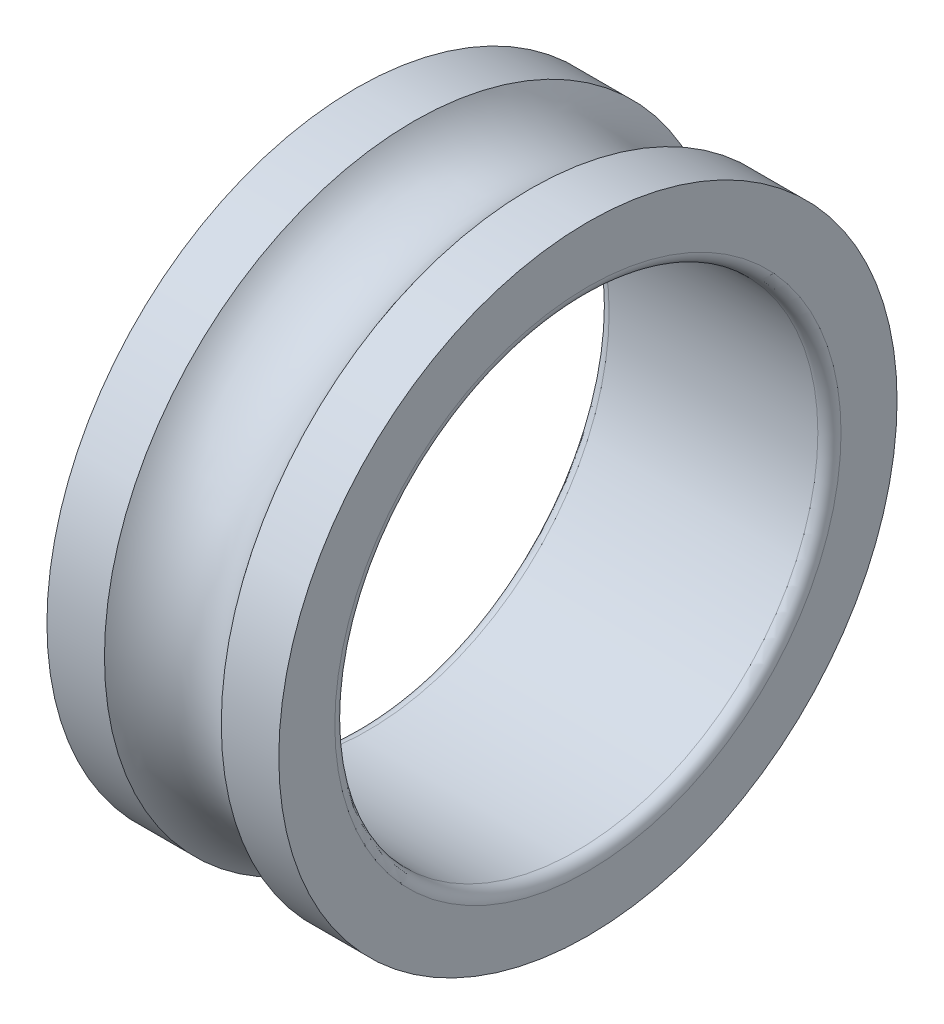
ISO-10303-21;
HEADER;
FILE_DESCRIPTION(('STEP AP214'),'2;1');
FILE_NAME('part.step','',(''),(''),'','','');
FILE_SCHEMA(('AUTOMOTIVE_DESIGN { 1 0 10303 214 1 1 1 1 }'));
ENDSEC;
DATA;
#1=APPLICATION_CONTEXT('core data for automotive mechanical design processes');
#2=APPLICATION_PROTOCOL_DEFINITION('international standard','automotive_design',2000,#1);
#3=PRODUCT_CONTEXT('',#1,'mechanical');
#4=PRODUCT('Part','Part','',(#3));
#5=PRODUCT_RELATED_PRODUCT_CATEGORY('part','',(#4));
#6=PRODUCT_DEFINITION_FORMATION('','',#4);
#7=PRODUCT_DEFINITION_CONTEXT('part definition',#1,'design');
#8=PRODUCT_DEFINITION('design','',#6,#7);
#9=PRODUCT_DEFINITION_SHAPE('','',#8);
#10=(LENGTH_UNIT() NAMED_UNIT(*) SI_UNIT(.MILLI.,.METRE.));
#11=(NAMED_UNIT(*) PLANE_ANGLE_UNIT() SI_UNIT($,.RADIAN.));
#12=(NAMED_UNIT(*) SI_UNIT($,.STERADIAN.) SOLID_ANGLE_UNIT());
#13=UNCERTAINTY_MEASURE_WITH_UNIT(LENGTH_MEASURE(1.E-05),#10,'distance_accuracy_value','');
#14=(GEOMETRIC_REPRESENTATION_CONTEXT(3) GLOBAL_UNCERTAINTY_ASSIGNED_CONTEXT((#13)) GLOBAL_UNIT_ASSIGNED_CONTEXT((#10,
#11,#12)) REPRESENTATION_CONTEXT('',''));
#15=CARTESIAN_POINT('',(0.,0.,0.));
#16=DIRECTION('',(0.,0.,1.));
#17=DIRECTION('',(1.,0.,0.));
#18=AXIS2_PLACEMENT_3D('',#15,#16,#17);
#19=CARTESIAN_POINT('',(0.,0.,0.));
#20=DIRECTION('',(-1.,0.,0.));
#21=DIRECTION('',(0.,0.,1.));
#22=AXIS2_PLACEMENT_3D('',#19,#20,#21);
#23=CYLINDRICAL_SURFACE('',#22,16.);
#24=CARTESIAN_POINT('',(0.,0.,0.));
#25=DIRECTION('',(-1.,0.,0.));
#26=DIRECTION('',(0.,0.,1.));
#27=AXIS2_PLACEMENT_3D('',#24,#25,#26);
#28=CIRCLE('',#27,16.);
#29=CARTESIAN_POINT('',(0.,0.,16.));
#30=VERTEX_POINT('',#29);
#31=EDGE_CURVE('E10',#30,#30,#28,.T.);
#32=ORIENTED_EDGE('',*,*,#31,.F.);
#33=EDGE_LOOP('',(#32));
#34=FACE_BOUND('',#33,.T.);
#35=CARTESIAN_POINT('',(2.97695196127411,0.,0.));
#36=DIRECTION('',(-1.,0.,0.));
#37=DIRECTION('',(0.,0.,1.));
#38=AXIS2_PLACEMENT_3D('',#35,#36,#37);
#39=CIRCLE('',#38,16.);
#40=CARTESIAN_POINT('',(2.97695196127411,0.,16.));
#41=VERTEX_POINT('',#40);
#42=EDGE_CURVE('E42',#41,#41,#39,.T.);
#43=ORIENTED_EDGE('',*,*,#42,.T.);
#44=EDGE_LOOP('',(#43));
#45=FACE_BOUND('',#44,.T.);
#46=ADVANCED_FACE('F14',(#34,#45),#23,.T.);
#47=CARTESIAN_POINT('',(0.,16.0000000000001,0.));
#48=DIRECTION('',(1.,0.,0.));
#49=DIRECTION('',(0.,0.,-1.));
#50=AXIS2_PLACEMENT_3D('',#47,#48,#49);
#51=PLANE('',#50);
#52=CARTESIAN_POINT('',(0.,0.,0.));
#53=DIRECTION('',(-1.,0.,0.));
#54=DIRECTION('',(0.,0.,1.));
#55=AXIS2_PLACEMENT_3D('',#52,#53,#54);
#56=CIRCLE('',#55,13.1);
#57=CARTESIAN_POINT('',(0.,0.,13.1));
#58=VERTEX_POINT('',#57);
#59=EDGE_CURVE('E20',#58,#58,#56,.T.);
#60=ORIENTED_EDGE('',*,*,#59,.F.);
#61=EDGE_LOOP('',(#60));
#62=FACE_BOUND('',#61,.T.);
#63=ORIENTED_EDGE('',*,*,#31,.T.);
#64=EDGE_LOOP('',(#63));
#65=FACE_BOUND('',#64,.T.);
#66=ADVANCED_FACE('F60',(#62,#65),#51,.F.);
#67=CARTESIAN_POINT('',(0.6,0.,0.));
#68=DIRECTION('',(-1.,0.,0.));
#69=DIRECTION('',(0.,0.,1.));
#70=AXIS2_PLACEMENT_3D('',#67,#68,#69);
#71=TOROIDAL_SURFACE('',#70,13.1,0.6);
#72=CARTESIAN_POINT('',(0.6,0.,0.));
#73=DIRECTION('',(-1.,0.,0.));
#74=DIRECTION('',(0.,0.,1.));
#75=AXIS2_PLACEMENT_3D('',#72,#73,#74);
#76=CIRCLE('',#75,12.5);
#77=CARTESIAN_POINT('',(0.6,0.,12.5));
#78=VERTEX_POINT('',#77);
#79=EDGE_CURVE('E24',#78,#78,#76,.T.);
#80=ORIENTED_EDGE('',*,*,#79,.F.);
#81=EDGE_LOOP('',(#80));
#82=FACE_BOUND('',#81,.T.);
#83=ORIENTED_EDGE('',*,*,#59,.T.);
#84=EDGE_LOOP('',(#83));
#85=FACE_BOUND('',#84,.T.);
#86=ADVANCED_FACE('F65',(#82,#85),#71,.T.);
#87=CARTESIAN_POINT('',(0.,0.,0.));
#88=DIRECTION('',(-1.,0.,0.));
#89=DIRECTION('',(0.,0.,1.));
#90=AXIS2_PLACEMENT_3D('',#87,#88,#89);
#91=CYLINDRICAL_SURFACE('',#90,12.5);
#92=CARTESIAN_POINT('',(11.4,0.,0.));
#93=DIRECTION('',(-1.,0.,0.));
#94=DIRECTION('',(0.,0.,1.));
#95=AXIS2_PLACEMENT_3D('',#92,#93,#94);
#96=CIRCLE('',#95,12.5);
#97=CARTESIAN_POINT('',(11.4,0.,12.5));
#98=VERTEX_POINT('',#97);
#99=EDGE_CURVE('E28',#98,#98,#96,.T.);
#100=ORIENTED_EDGE('',*,*,#99,.F.);
#101=EDGE_LOOP('',(#100));
#102=FACE_BOUND('',#101,.T.);
#103=ORIENTED_EDGE('',*,*,#79,.T.);
#104=EDGE_LOOP('',(#103));
#105=FACE_BOUND('',#104,.T.);
#106=ADVANCED_FACE('F70',(#102,#105),#91,.F.);
#107=CARTESIAN_POINT('',(11.4,0.,0.));
#108=DIRECTION('',(-1.,0.,0.));
#109=DIRECTION('',(0.,0.,1.));
#110=AXIS2_PLACEMENT_3D('',#107,#108,#109);
#111=TOROIDAL_SURFACE('',#110,13.1,0.6);
#112=CARTESIAN_POINT('',(12.,0.,0.));
#113=DIRECTION('',(-1.,0.,0.));
#114=DIRECTION('',(0.,0.,1.));
#115=AXIS2_PLACEMENT_3D('',#112,#113,#114);
#116=CIRCLE('',#115,13.1);
#117=CARTESIAN_POINT('',(12.,0.,13.1));
#118=VERTEX_POINT('',#117);
#119=EDGE_CURVE('E33',#118,#118,#116,.T.);
#120=ORIENTED_EDGE('',*,*,#119,.F.);
#121=EDGE_LOOP('',(#120));
#122=FACE_BOUND('',#121,.T.);
#123=ORIENTED_EDGE('',*,*,#99,.T.);
#124=EDGE_LOOP('',(#123));
#125=FACE_BOUND('',#124,.T.);
#126=ADVANCED_FACE('F76',(#122,#125),#111,.T.);
#127=CARTESIAN_POINT('',(12.,13.1,0.));
#128=DIRECTION('',(-1.,0.,0.));
#129=DIRECTION('',(0.,0.,1.));
#130=AXIS2_PLACEMENT_3D('',#127,#128,#129);
#131=PLANE('',#130);
#132=CARTESIAN_POINT('',(12.,0.,0.));
#133=DIRECTION('',(-1.,0.,0.));
#134=DIRECTION('',(0.,0.,1.));
#135=AXIS2_PLACEMENT_3D('',#132,#133,#134);
#136=CIRCLE('',#135,16.);
#137=CARTESIAN_POINT('',(12.,0.,16.));
#138=VERTEX_POINT('',#137);
#139=EDGE_CURVE('E36',#138,#138,#136,.T.);
#140=ORIENTED_EDGE('',*,*,#139,.F.);
#141=EDGE_LOOP('',(#140));
#142=FACE_BOUND('',#141,.T.);
#143=ORIENTED_EDGE('',*,*,#119,.T.);
#144=EDGE_LOOP('',(#143));
#145=FACE_BOUND('',#144,.T.);
#146=ADVANCED_FACE('F56',(#142,#145),#131,.F.);
#147=CARTESIAN_POINT('',(0.,0.,0.));
#148=DIRECTION('',(-1.,0.,0.));
#149=DIRECTION('',(0.,0.,1.));
#150=AXIS2_PLACEMENT_3D('',#147,#148,#149);
#151=CYLINDRICAL_SURFACE('',#150,16.);
#152=CARTESIAN_POINT('',(9.02304803872589,0.,0.));
#153=DIRECTION('',(-1.,0.,0.));
#154=DIRECTION('',(0.,0.,1.));
#155=AXIS2_PLACEMENT_3D('',#152,#153,#154);
#156=CIRCLE('',#155,16.);
#157=CARTESIAN_POINT('',(9.02304803872589,0.,16.));
#158=VERTEX_POINT('',#157);
#159=EDGE_CURVE('E39',#158,#158,#156,.T.);
#160=ORIENTED_EDGE('',*,*,#159,.F.);
#161=EDGE_LOOP('',(#160));
#162=FACE_BOUND('',#161,.T.);
#163=ORIENTED_EDGE('',*,*,#139,.T.);
#164=EDGE_LOOP('',(#163));
#165=FACE_BOUND('',#164,.T.);
#166=ADVANCED_FACE('F49',(#162,#165),#151,.T.);
#167=CARTESIAN_POINT('',(6.,0.,0.));
#168=DIRECTION('',(-1.,0.,0.));
#169=DIRECTION('',(0.,0.,1.));
#170=AXIS2_PLACEMENT_3D('',#167,#168,#169);
#171=TOROIDAL_SURFACE('',#170,18.075,3.66666666666666);
#172=ORIENTED_EDGE('',*,*,#159,.T.);
#173=EDGE_LOOP('',(#172));
#174=FACE_BOUND('',#173,.T.);
#175=ORIENTED_EDGE('',*,*,#42,.F.);
#176=EDGE_LOOP('',(#175));
#177=FACE_BOUND('',#176,.T.);
#178=ADVANCED_FACE('F47',(#174,#177),#171,.F.);
#179=CLOSED_SHELL('',(#46,#66,#86,#106,#126,#146,#166,#178));
#180=MANIFOLD_SOLID_BREP('B1',#179);
#181=ADVANCED_BREP_SHAPE_REPRESENTATION('',(#18,#180),#14);
#182=SHAPE_DEFINITION_REPRESENTATION(#9,#181);
ENDSEC;
END-ISO-10303-21;
